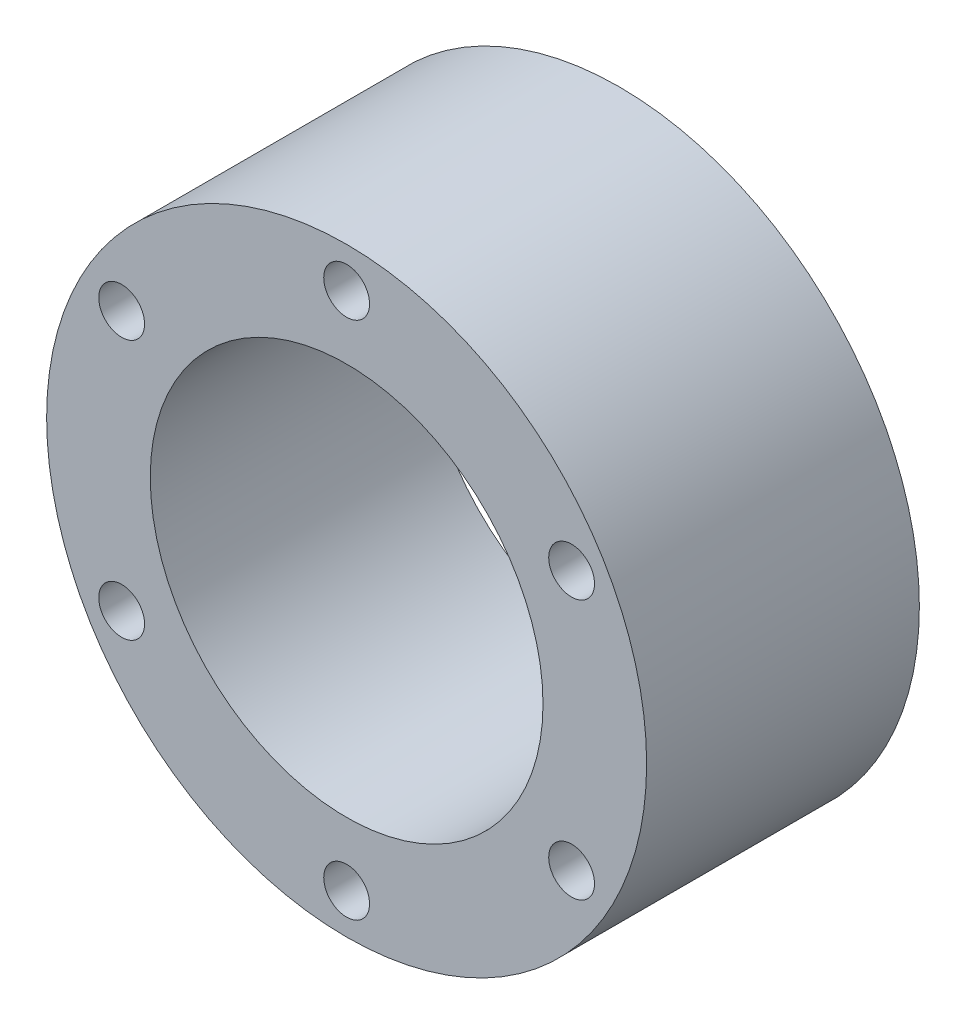
ISO-10303-21;
HEADER;
FILE_DESCRIPTION(('STEP AP214'),'2;1');
FILE_NAME('part.step','',(''),(''),'','','');
FILE_SCHEMA(('AUTOMOTIVE_DESIGN { 1 0 10303 214 1 1 1 1 }'));
ENDSEC;
DATA;
#1=APPLICATION_CONTEXT('core data for automotive mechanical design processes');
#2=APPLICATION_PROTOCOL_DEFINITION('international standard','automotive_design',2000,#1);
#3=PRODUCT_CONTEXT('',#1,'mechanical');
#4=PRODUCT('Part','Part','',(#3));
#5=PRODUCT_RELATED_PRODUCT_CATEGORY('part','',(#4));
#6=PRODUCT_DEFINITION_FORMATION('','',#4);
#7=PRODUCT_DEFINITION_CONTEXT('part definition',#1,'design');
#8=PRODUCT_DEFINITION('design','',#6,#7);
#9=PRODUCT_DEFINITION_SHAPE('','',#8);
#10=(LENGTH_UNIT() NAMED_UNIT(*) SI_UNIT(.MILLI.,.METRE.));
#11=(NAMED_UNIT(*) PLANE_ANGLE_UNIT() SI_UNIT($,.RADIAN.));
#12=(NAMED_UNIT(*) SI_UNIT($,.STERADIAN.) SOLID_ANGLE_UNIT());
#13=UNCERTAINTY_MEASURE_WITH_UNIT(LENGTH_MEASURE(1.E-05),#10,'distance_accuracy_value','');
#14=(GEOMETRIC_REPRESENTATION_CONTEXT(3) GLOBAL_UNCERTAINTY_ASSIGNED_CONTEXT((#13)) GLOBAL_UNIT_ASSIGNED_CONTEXT((#10,
#11,#12)) REPRESENTATION_CONTEXT('',''));
#15=CARTESIAN_POINT('',(0.,0.,0.));
#16=DIRECTION('',(0.,0.,1.));
#17=DIRECTION('',(1.,0.,0.));
#18=AXIS2_PLACEMENT_3D('',#15,#16,#17);
#19=CARTESIAN_POINT('',(0.,0.,-12.5));
#20=DIRECTION('',(0.,0.,1.));
#21=DIRECTION('',(1.,0.,0.));
#22=AXIS2_PLACEMENT_3D('',#19,#20,#21);
#23=PLANE('',#22);
#24=CARTESIAN_POINT('',(20.6222299276171,-11.9062499999998,-12.5));
#25=DIRECTION('',(0.,0.,-1.));
#26=DIRECTION('',(-1.,0.,0.));
#27=AXIS2_PLACEMENT_3D('',#24,#25,#26);
#28=CIRCLE('',#27,2.1);
#29=CARTESIAN_POINT('',(18.5222299276171,-11.9062499999998,-12.5));
#30=VERTEX_POINT('',#29);
#31=EDGE_CURVE('E76',#30,#30,#28,.T.);
#32=ORIENTED_EDGE('',*,*,#31,.F.);
#33=EDGE_LOOP('',(#32));
#34=FACE_BOUND('',#33,.T.);
#35=CARTESIAN_POINT('',(-20.6222299276169,-11.9062500000001,-12.5));
#36=DIRECTION('',(0.,0.,-1.));
#37=DIRECTION('',(-1.,0.,0.));
#38=AXIS2_PLACEMENT_3D('',#35,#36,#37);
#39=CIRCLE('',#38,2.1);
#40=CARTESIAN_POINT('',(-22.7222299276169,-11.9062500000001,-12.5));
#41=VERTEX_POINT('',#40);
#42=EDGE_CURVE('E64',#41,#41,#39,.T.);
#43=ORIENTED_EDGE('',*,*,#42,.F.);
#44=EDGE_LOOP('',(#43));
#45=FACE_BOUND('',#44,.T.);
#46=CARTESIAN_POINT('',(-20.622229927617,11.90625,-12.5));
#47=DIRECTION('',(0.,0.,-1.));
#48=DIRECTION('',(-1.,0.,0.));
#49=AXIS2_PLACEMENT_3D('',#46,#47,#48);
#50=CIRCLE('',#49,2.1);
#51=CARTESIAN_POINT('',(-22.722229927617,11.90625,-12.5));
#52=VERTEX_POINT('',#51);
#53=EDGE_CURVE('E58',#52,#52,#50,.T.);
#54=ORIENTED_EDGE('',*,*,#53,.F.);
#55=EDGE_LOOP('',(#54));
#56=FACE_BOUND('',#55,.T.);
#57=CARTESIAN_POINT('',(0.,23.8125,-12.5));
#58=DIRECTION('',(0.,0.,-1.));
#59=DIRECTION('',(-1.,0.,0.));
#60=AXIS2_PLACEMENT_3D('',#57,#58,#59);
#61=CIRCLE('',#60,2.1);
#62=CARTESIAN_POINT('',(-2.1,23.8125,-12.5));
#63=VERTEX_POINT('',#62);
#64=EDGE_CURVE('E52',#63,#63,#61,.T.);
#65=ORIENTED_EDGE('',*,*,#64,.F.);
#66=EDGE_LOOP('',(#65));
#67=FACE_BOUND('',#66,.T.);
#68=CARTESIAN_POINT('',(0.,0.,-12.5));
#69=DIRECTION('',(0.,0.,1.));
#70=DIRECTION('',(1.,0.,0.));
#71=AXIS2_PLACEMENT_3D('',#68,#69,#70);
#72=CIRCLE('',#71,27.5);
#73=CARTESIAN_POINT('',(27.5,0.,-12.5));
#74=VERTEX_POINT('',#73);
#75=EDGE_CURVE('E35',#74,#74,#72,.T.);
#76=ORIENTED_EDGE('',*,*,#75,.F.);
#77=EDGE_LOOP('',(#76));
#78=FACE_BOUND('',#77,.T.);
#79=CARTESIAN_POINT('',(0.,0.,-12.5));
#80=DIRECTION('',(0.,0.,1.));
#81=DIRECTION('',(1.,0.,0.));
#82=AXIS2_PLACEMENT_3D('',#79,#80,#81);
#83=CIRCLE('',#82,18.);
#84=CARTESIAN_POINT('',(18.,0.,-12.5));
#85=VERTEX_POINT('',#84);
#86=EDGE_CURVE('E44',#85,#85,#83,.T.);
#87=ORIENTED_EDGE('',*,*,#86,.T.);
#88=EDGE_LOOP('',(#87));
#89=FACE_BOUND('',#88,.T.);
#90=CARTESIAN_POINT('',(0.,-23.8125,-12.5));
#91=DIRECTION('',(0.,0.,-1.));
#92=DIRECTION('',(-1.,0.,0.));
#93=AXIS2_PLACEMENT_3D('',#90,#91,#92);
#94=CIRCLE('',#93,2.1);
#95=CARTESIAN_POINT('',(-2.1,-23.8125,-12.5));
#96=VERTEX_POINT('',#95);
#97=EDGE_CURVE('E70',#96,#96,#94,.T.);
#98=ORIENTED_EDGE('',*,*,#97,.F.);
#99=EDGE_LOOP('',(#98));
#100=FACE_BOUND('',#99,.T.);
#101=CARTESIAN_POINT('',(20.6222299276168,11.9062500000002,-12.5));
#102=DIRECTION('',(0.,0.,-1.));
#103=DIRECTION('',(-1.,0.,0.));
#104=AXIS2_PLACEMENT_3D('',#101,#102,#103);
#105=CIRCLE('',#104,2.1);
#106=CARTESIAN_POINT('',(18.5222299276168,11.9062500000002,-12.5));
#107=VERTEX_POINT('',#106);
#108=EDGE_CURVE('E82',#107,#107,#105,.T.);
#109=ORIENTED_EDGE('',*,*,#108,.F.);
#110=EDGE_LOOP('',(#109));
#111=FACE_BOUND('',#110,.T.);
#112=ADVANCED_FACE('F31',(#34,#45,#56,#67,#78,#89,#100,#111),#23,.F.);
#113=CARTESIAN_POINT('',(0.,0.,12.5));
#114=DIRECTION('',(0.,0.,1.));
#115=DIRECTION('',(1.,0.,0.));
#116=AXIS2_PLACEMENT_3D('',#113,#114,#115);
#117=PLANE('',#116);
#118=CARTESIAN_POINT('',(20.6222299276168,11.9062500000002,12.5));
#119=DIRECTION('',(0.,0.,1.));
#120=DIRECTION('',(1.,0.,0.));
#121=AXIS2_PLACEMENT_3D('',#118,#119,#120);
#122=CIRCLE('',#121,2.1);
#123=CARTESIAN_POINT('',(22.7222299276168,11.9062500000002,12.5));
#124=VERTEX_POINT('',#123);
#125=EDGE_CURVE('E79',#124,#124,#122,.T.);
#126=ORIENTED_EDGE('',*,*,#125,.F.);
#127=EDGE_LOOP('',(#126));
#128=FACE_BOUND('',#127,.T.);
#129=CARTESIAN_POINT('',(20.6222299276171,-11.9062499999998,12.5));
#130=DIRECTION('',(0.,0.,1.));
#131=DIRECTION('',(1.,0.,0.));
#132=AXIS2_PLACEMENT_3D('',#129,#130,#131);
#133=CIRCLE('',#132,2.1);
#134=CARTESIAN_POINT('',(22.7222299276171,-11.9062499999998,12.5));
#135=VERTEX_POINT('',#134);
#136=EDGE_CURVE('E73',#135,#135,#133,.T.);
#137=ORIENTED_EDGE('',*,*,#136,.F.);
#138=EDGE_LOOP('',(#137));
#139=FACE_BOUND('',#138,.T.);
#140=CARTESIAN_POINT('',(0.,-23.8125,12.5));
#141=DIRECTION('',(0.,0.,1.));
#142=DIRECTION('',(1.,0.,0.));
#143=AXIS2_PLACEMENT_3D('',#140,#141,#142);
#144=CIRCLE('',#143,2.1);
#145=CARTESIAN_POINT('',(2.1,-23.8125,12.5));
#146=VERTEX_POINT('',#145);
#147=EDGE_CURVE('E67',#146,#146,#144,.T.);
#148=ORIENTED_EDGE('',*,*,#147,.F.);
#149=EDGE_LOOP('',(#148));
#150=FACE_BOUND('',#149,.T.);
#151=CARTESIAN_POINT('',(-20.6222299276169,-11.9062500000001,12.5));
#152=DIRECTION('',(0.,0.,1.));
#153=DIRECTION('',(1.,0.,0.));
#154=AXIS2_PLACEMENT_3D('',#151,#152,#153);
#155=CIRCLE('',#154,2.1);
#156=CARTESIAN_POINT('',(-18.5222299276169,-11.9062500000001,12.5));
#157=VERTEX_POINT('',#156);
#158=EDGE_CURVE('E61',#157,#157,#155,.T.);
#159=ORIENTED_EDGE('',*,*,#158,.F.);
#160=EDGE_LOOP('',(#159));
#161=FACE_BOUND('',#160,.T.);
#162=CARTESIAN_POINT('',(-20.622229927617,11.90625,12.5));
#163=DIRECTION('',(0.,0.,1.));
#164=DIRECTION('',(1.,0.,0.));
#165=AXIS2_PLACEMENT_3D('',#162,#163,#164);
#166=CIRCLE('',#165,2.1);
#167=CARTESIAN_POINT('',(-18.522229927617,11.90625,12.5));
#168=VERTEX_POINT('',#167);
#169=EDGE_CURVE('E55',#168,#168,#166,.T.);
#170=ORIENTED_EDGE('',*,*,#169,.F.);
#171=EDGE_LOOP('',(#170));
#172=FACE_BOUND('',#171,.T.);
#173=CARTESIAN_POINT('',(0.,23.8125,12.5));
#174=DIRECTION('',(0.,0.,1.));
#175=DIRECTION('',(1.,0.,0.));
#176=AXIS2_PLACEMENT_3D('',#173,#174,#175);
#177=CIRCLE('',#176,2.09999999999999);
#178=CARTESIAN_POINT('',(2.09999999999999,23.8125,12.5));
#179=VERTEX_POINT('',#178);
#180=EDGE_CURVE('E47',#179,#179,#177,.T.);
#181=ORIENTED_EDGE('',*,*,#180,.F.);
#182=EDGE_LOOP('',(#181));
#183=FACE_BOUND('',#182,.T.);
#184=CARTESIAN_POINT('',(0.,0.,12.5));
#185=DIRECTION('',(0.,0.,1.));
#186=DIRECTION('',(1.,0.,0.));
#187=AXIS2_PLACEMENT_3D('',#184,#185,#186);
#188=CIRCLE('',#187,27.5);
#189=CARTESIAN_POINT('',(27.5,0.,12.5));
#190=VERTEX_POINT('',#189);
#191=EDGE_CURVE('E10',#190,#190,#188,.T.);
#192=ORIENTED_EDGE('',*,*,#191,.T.);
#193=EDGE_LOOP('',(#192));
#194=FACE_BOUND('',#193,.T.);
#195=CARTESIAN_POINT('',(0.,0.,12.5));
#196=DIRECTION('',(0.,0.,1.));
#197=DIRECTION('',(1.,0.,0.));
#198=AXIS2_PLACEMENT_3D('',#195,#196,#197);
#199=CIRCLE('',#198,18.);
#200=CARTESIAN_POINT('',(18.,0.,12.5));
#201=VERTEX_POINT('',#200);
#202=EDGE_CURVE('E42',#201,#201,#199,.T.);
#203=ORIENTED_EDGE('',*,*,#202,.F.);
#204=EDGE_LOOP('',(#203));
#205=FACE_BOUND('',#204,.T.);
#206=ADVANCED_FACE('F90',(#128,#139,#150,#161,#172,#183,#194,#205),#117,.T.);
#207=CARTESIAN_POINT('',(0.,0.,12.5));
#208=DIRECTION('',(0.,0.,-1.));
#209=DIRECTION('',(-1.,0.,0.));
#210=AXIS2_PLACEMENT_3D('',#207,#208,#209);
#211=CYLINDRICAL_SURFACE('',#210,27.5);
#212=ORIENTED_EDGE('',*,*,#191,.F.);
#213=EDGE_LOOP('',(#212));
#214=FACE_BOUND('',#213,.T.);
#215=ORIENTED_EDGE('',*,*,#75,.T.);
#216=EDGE_LOOP('',(#215));
#217=FACE_BOUND('',#216,.T.);
#218=ADVANCED_FACE('F33',(#214,#217),#211,.T.);
#219=CARTESIAN_POINT('',(0.,0.,12.5));
#220=DIRECTION('',(0.,0.,-1.));
#221=DIRECTION('',(-1.,0.,0.));
#222=AXIS2_PLACEMENT_3D('',#219,#220,#221);
#223=CYLINDRICAL_SURFACE('',#222,18.);
#224=ORIENTED_EDGE('',*,*,#202,.T.);
#225=EDGE_LOOP('',(#224));
#226=FACE_BOUND('',#225,.T.);
#227=ORIENTED_EDGE('',*,*,#86,.F.);
#228=EDGE_LOOP('',(#227));
#229=FACE_BOUND('',#228,.T.);
#230=ADVANCED_FACE('F100',(#226,#229),#223,.F.);
#231=CARTESIAN_POINT('',(0.,23.8125,-12.5));
#232=DIRECTION('',(0.,0.,-1.));
#233=DIRECTION('',(-1.,0.,0.));
#234=AXIS2_PLACEMENT_3D('',#231,#232,#233);
#235=CYLINDRICAL_SURFACE('',#234,2.09999999999999);
#236=ORIENTED_EDGE('',*,*,#64,.T.);
#237=EDGE_LOOP('',(#236));
#238=FACE_BOUND('',#237,.T.);
#239=ORIENTED_EDGE('',*,*,#180,.T.);
#240=EDGE_LOOP('',(#239));
#241=FACE_BOUND('',#240,.T.);
#242=ADVANCED_FACE('F103',(#238,#241),#235,.F.);
#243=CARTESIAN_POINT('',(-20.622229927617,11.90625,-12.5));
#244=DIRECTION('',(0.,0.,-1.));
#245=DIRECTION('',(-1.,0.,0.));
#246=AXIS2_PLACEMENT_3D('',#243,#244,#245);
#247=CYLINDRICAL_SURFACE('',#246,2.1);
#248=ORIENTED_EDGE('',*,*,#53,.T.);
#249=EDGE_LOOP('',(#248));
#250=FACE_BOUND('',#249,.T.);
#251=ORIENTED_EDGE('',*,*,#169,.T.);
#252=EDGE_LOOP('',(#251));
#253=FACE_BOUND('',#252,.T.);
#254=ADVANCED_FACE('F107',(#250,#253),#247,.F.);
#255=CARTESIAN_POINT('',(-20.6222299276169,-11.9062500000001,-12.5));
#256=DIRECTION('',(0.,0.,-1.));
#257=DIRECTION('',(-1.,0.,0.));
#258=AXIS2_PLACEMENT_3D('',#255,#256,#257);
#259=CYLINDRICAL_SURFACE('',#258,2.1);
#260=ORIENTED_EDGE('',*,*,#42,.T.);
#261=EDGE_LOOP('',(#260));
#262=FACE_BOUND('',#261,.T.);
#263=ORIENTED_EDGE('',*,*,#158,.T.);
#264=EDGE_LOOP('',(#263));
#265=FACE_BOUND('',#264,.T.);
#266=ADVANCED_FACE('F111',(#262,#265),#259,.F.);
#267=CARTESIAN_POINT('',(0.,-23.8125,-12.5));
#268=DIRECTION('',(0.,0.,-1.));
#269=DIRECTION('',(-1.,0.,0.));
#270=AXIS2_PLACEMENT_3D('',#267,#268,#269);
#271=CYLINDRICAL_SURFACE('',#270,2.1);
#272=ORIENTED_EDGE('',*,*,#97,.T.);
#273=EDGE_LOOP('',(#272));
#274=FACE_BOUND('',#273,.T.);
#275=ORIENTED_EDGE('',*,*,#147,.T.);
#276=EDGE_LOOP('',(#275));
#277=FACE_BOUND('',#276,.T.);
#278=ADVANCED_FACE('F115',(#274,#277),#271,.F.);
#279=CARTESIAN_POINT('',(20.6222299276171,-11.9062499999998,-12.5));
#280=DIRECTION('',(0.,0.,-1.));
#281=DIRECTION('',(-1.,0.,0.));
#282=AXIS2_PLACEMENT_3D('',#279,#280,#281);
#283=CYLINDRICAL_SURFACE('',#282,2.1);
#284=ORIENTED_EDGE('',*,*,#31,.T.);
#285=EDGE_LOOP('',(#284));
#286=FACE_BOUND('',#285,.T.);
#287=ORIENTED_EDGE('',*,*,#136,.T.);
#288=EDGE_LOOP('',(#287));
#289=FACE_BOUND('',#288,.T.);
#290=ADVANCED_FACE('F119',(#286,#289),#283,.F.);
#291=CARTESIAN_POINT('',(20.6222299276168,11.9062500000002,-12.5));
#292=DIRECTION('',(0.,0.,-1.));
#293=DIRECTION('',(-1.,0.,0.));
#294=AXIS2_PLACEMENT_3D('',#291,#292,#293);
#295=CYLINDRICAL_SURFACE('',#294,2.1);
#296=ORIENTED_EDGE('',*,*,#108,.T.);
#297=EDGE_LOOP('',(#296));
#298=FACE_BOUND('',#297,.T.);
#299=ORIENTED_EDGE('',*,*,#125,.T.);
#300=EDGE_LOOP('',(#299));
#301=FACE_BOUND('',#300,.T.);
#302=ADVANCED_FACE('F86',(#298,#301),#295,.F.);
#303=CLOSED_SHELL('',(#112,#206,#218,#230,#242,#254,#266,#278,#290,#302));
#304=MANIFOLD_SOLID_BREP('B2',#303);
#305=ADVANCED_BREP_SHAPE_REPRESENTATION('',(#18,#304),#14);
#306=SHAPE_DEFINITION_REPRESENTATION(#9,#305);
ENDSEC;
END-ISO-10303-21;
